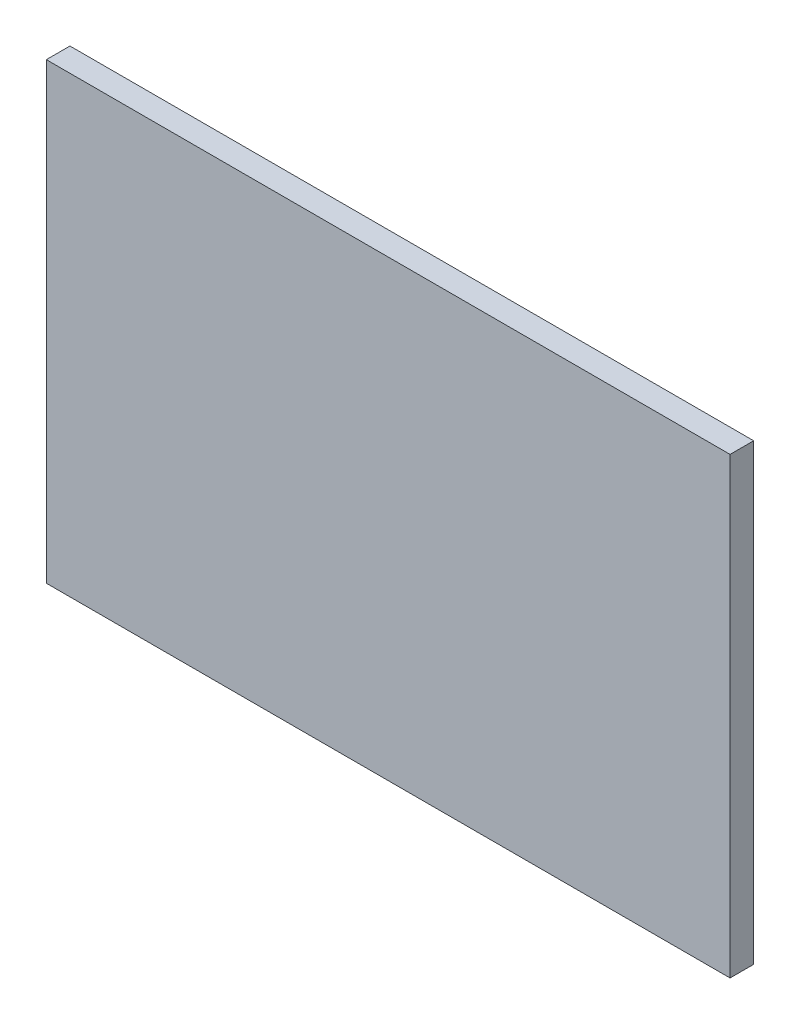
ISO-10303-21;
HEADER;
FILE_DESCRIPTION(('STEP AP214'),'2;1');
FILE_NAME('part.step','',(''),(''),'','','');
FILE_SCHEMA(('AUTOMOTIVE_DESIGN { 1 0 10303 214 1 1 1 1 }'));
ENDSEC;
DATA;
#1=APPLICATION_CONTEXT('core data for automotive mechanical design processes');
#2=APPLICATION_PROTOCOL_DEFINITION('international standard','automotive_design',2000,#1);
#3=PRODUCT_CONTEXT('',#1,'mechanical');
#4=PRODUCT('Part','Part','',(#3));
#5=PRODUCT_RELATED_PRODUCT_CATEGORY('part','',(#4));
#6=PRODUCT_DEFINITION_FORMATION('','',#4);
#7=PRODUCT_DEFINITION_CONTEXT('part definition',#1,'design');
#8=PRODUCT_DEFINITION('design','',#6,#7);
#9=PRODUCT_DEFINITION_SHAPE('','',#8);
#10=(LENGTH_UNIT() NAMED_UNIT(*) SI_UNIT(.MILLI.,.METRE.));
#11=(NAMED_UNIT(*) PLANE_ANGLE_UNIT() SI_UNIT($,.RADIAN.));
#12=(NAMED_UNIT(*) SI_UNIT($,.STERADIAN.) SOLID_ANGLE_UNIT());
#13=UNCERTAINTY_MEASURE_WITH_UNIT(LENGTH_MEASURE(1.E-05),#10,'distance_accuracy_value','');
#14=(GEOMETRIC_REPRESENTATION_CONTEXT(3) GLOBAL_UNCERTAINTY_ASSIGNED_CONTEXT((#13)) GLOBAL_UNIT_ASSIGNED_CONTEXT((#10,
#11,#12)) REPRESENTATION_CONTEXT('',''));
#15=CARTESIAN_POINT('',(0.,0.,0.));
#16=DIRECTION('',(0.,0.,1.));
#17=DIRECTION('',(1.,0.,0.));
#18=AXIS2_PLACEMENT_3D('',#15,#16,#17);
#19=CARTESIAN_POINT('',(-919.1625,1219.2,31.7500000000001));
#20=DIRECTION('',(1.,0.,0.));
#21=DIRECTION('',(0.,0.,-1.));
#22=AXIS2_PLACEMENT_3D('',#19,#20,#21);
#23=PLANE('',#22);
#24=DIRECTION('',(0.,0.,1.));
#25=VECTOR('',#24,1.);
#26=CARTESIAN_POINT('',(-919.1625,0.,31.7500000000001));
#27=LINE('',#26,#25);
#28=CARTESIAN_POINT('',(-919.1625,0.,-31.7499999999999));
#29=VERTEX_POINT('',#28);
#30=CARTESIAN_POINT('',(-919.1625,0.,31.7500000000001));
#31=VERTEX_POINT('',#30);
#32=EDGE_CURVE('E97',#29,#31,#27,.T.);
#33=ORIENTED_EDGE('',*,*,#32,.T.);
#34=DIRECTION('',(0.,-1.,0.));
#35=VECTOR('',#34,1.);
#36=CARTESIAN_POINT('',(-919.1625,1219.2,31.7500000000001));
#37=LINE('',#36,#35);
#38=CARTESIAN_POINT('',(-919.1625,1219.2,31.7500000000001));
#39=VERTEX_POINT('',#38);
#40=EDGE_CURVE('E11',#39,#31,#37,.T.);
#41=ORIENTED_EDGE('',*,*,#40,.F.);
#42=DIRECTION('',(0.,0.,1.));
#43=VECTOR('',#42,1.);
#44=CARTESIAN_POINT('',(-919.1625,1219.2,31.7500000000001));
#45=LINE('',#44,#43);
#46=CARTESIAN_POINT('',(-919.1625,1219.2,-31.7499999999999));
#47=VERTEX_POINT('',#46);
#48=EDGE_CURVE('E85',#47,#39,#45,.T.);
#49=ORIENTED_EDGE('',*,*,#48,.F.);
#50=DIRECTION('',(0.,-1.,0.));
#51=VECTOR('',#50,1.);
#52=CARTESIAN_POINT('',(-919.1625,1219.2,-31.7499999999999));
#53=LINE('',#52,#51);
#54=EDGE_CURVE('E93',#47,#29,#53,.T.);
#55=ORIENTED_EDGE('',*,*,#54,.T.);
#56=EDGE_LOOP('',(#33,#41,#49,#55));
#57=FACE_BOUND('',#56,.T.);
#58=ADVANCED_FACE('F34',(#57),#23,.F.);
#59=CARTESIAN_POINT('',(919.1625,1219.2,31.7499999999999));
#60=DIRECTION('',(0.,0.,-1.));
#61=DIRECTION('',(-1.,0.,0.));
#62=AXIS2_PLACEMENT_3D('',#59,#60,#61);
#63=PLANE('',#62);
#64=DIRECTION('',(1.,0.,0.));
#65=VECTOR('',#64,1.);
#66=CARTESIAN_POINT('',(919.1625,0.,31.7499999999999));
#67=LINE('',#66,#65);
#68=CARTESIAN_POINT('',(919.1625,0.,31.7499999999999));
#69=VERTEX_POINT('',#68);
#70=EDGE_CURVE('E89',#31,#69,#67,.T.);
#71=ORIENTED_EDGE('',*,*,#70,.T.);
#72=DIRECTION('',(0.,-1.,0.));
#73=VECTOR('',#72,1.);
#74=CARTESIAN_POINT('',(919.1625,1219.2,31.7499999999999));
#75=LINE('',#74,#73);
#76=CARTESIAN_POINT('',(919.1625,1219.2,31.7499999999999));
#77=VERTEX_POINT('',#76);
#78=EDGE_CURVE('E42',#77,#69,#75,.T.);
#79=ORIENTED_EDGE('',*,*,#78,.F.);
#80=DIRECTION('',(1.,0.,0.));
#81=VECTOR('',#80,1.);
#82=CARTESIAN_POINT('',(919.1625,1219.2,31.7499999999999));
#83=LINE('',#82,#81);
#84=EDGE_CURVE('E80',#39,#77,#83,.T.);
#85=ORIENTED_EDGE('',*,*,#84,.F.);
#86=ORIENTED_EDGE('',*,*,#40,.T.);
#87=EDGE_LOOP('',(#71,#79,#85,#86));
#88=FACE_BOUND('',#87,.T.);
#89=ADVANCED_FACE('F88',(#88),#63,.F.);
#90=CARTESIAN_POINT('',(919.1625,1219.2,31.7499999999999));
#91=DIRECTION('',(-1.,0.,0.));
#92=DIRECTION('',(0.,0.,1.));
#93=AXIS2_PLACEMENT_3D('',#90,#91,#92);
#94=PLANE('',#93);
#95=DIRECTION('',(0.,0.,-1.));
#96=VECTOR('',#95,1.);
#97=CARTESIAN_POINT('',(919.1625,0.,31.7499999999999));
#98=LINE('',#97,#96);
#99=CARTESIAN_POINT('',(919.1625,0.,-31.7500000000001));
#100=VERTEX_POINT('',#99);
#101=EDGE_CURVE('E67',#69,#100,#98,.T.);
#102=ORIENTED_EDGE('',*,*,#101,.T.);
#103=DIRECTION('',(0.,-1.,0.));
#104=VECTOR('',#103,1.);
#105=CARTESIAN_POINT('',(919.1625,1219.2,-31.7500000000001));
#106=LINE('',#105,#104);
#107=CARTESIAN_POINT('',(919.1625,1219.2,-31.7500000000001));
#108=VERTEX_POINT('',#107);
#109=EDGE_CURVE('E90',#108,#100,#106,.T.);
#110=ORIENTED_EDGE('',*,*,#109,.F.);
#111=DIRECTION('',(0.,0.,-1.));
#112=VECTOR('',#111,1.);
#113=CARTESIAN_POINT('',(919.1625,1219.2,31.7499999999999));
#114=LINE('',#113,#112);
#115=EDGE_CURVE('E83',#77,#108,#114,.T.);
#116=ORIENTED_EDGE('',*,*,#115,.F.);
#117=ORIENTED_EDGE('',*,*,#78,.T.);
#118=EDGE_LOOP('',(#102,#110,#116,#117));
#119=FACE_BOUND('',#118,.T.);
#120=ADVANCED_FACE('F91',(#119),#94,.F.);
#121=CARTESIAN_POINT('',(919.1625,1219.2,-31.7500000000001));
#122=DIRECTION('',(0.,0.,1.));
#123=DIRECTION('',(1.,0.,0.));
#124=AXIS2_PLACEMENT_3D('',#121,#122,#123);
#125=PLANE('',#124);
#126=DIRECTION('',(-1.,0.,0.));
#127=VECTOR('',#126,1.);
#128=CARTESIAN_POINT('',(919.1625,0.,-31.7500000000001));
#129=LINE('',#128,#127);
#130=EDGE_CURVE('E73',#100,#29,#129,.T.);
#131=ORIENTED_EDGE('',*,*,#130,.T.);
#132=ORIENTED_EDGE('',*,*,#54,.F.);
#133=DIRECTION('',(-1.,0.,0.));
#134=VECTOR('',#133,1.);
#135=CARTESIAN_POINT('',(919.1625,1219.2,-31.7500000000001));
#136=LINE('',#135,#134);
#137=EDGE_CURVE('E50',#108,#47,#136,.T.);
#138=ORIENTED_EDGE('',*,*,#137,.F.);
#139=ORIENTED_EDGE('',*,*,#109,.T.);
#140=EDGE_LOOP('',(#131,#132,#138,#139));
#141=FACE_BOUND('',#140,.T.);
#142=ADVANCED_FACE('F104',(#141),#125,.F.);
#143=CARTESIAN_POINT('',(0.,1219.2,0.));
#144=DIRECTION('',(0.,1.,0.));
#145=DIRECTION('',(0.,0.,1.));
#146=AXIS2_PLACEMENT_3D('',#143,#144,#145);
#147=PLANE('',#146);
#148=ORIENTED_EDGE('',*,*,#48,.T.);
#149=ORIENTED_EDGE('',*,*,#84,.T.);
#150=ORIENTED_EDGE('',*,*,#115,.T.);
#151=ORIENTED_EDGE('',*,*,#137,.T.);
#152=EDGE_LOOP('',(#148,#149,#150,#151));
#153=FACE_BOUND('',#152,.T.);
#154=ADVANCED_FACE('F81',(#153),#147,.T.);
#155=CARTESIAN_POINT('',(0.,0.,0.));
#156=DIRECTION('',(0.,1.,0.));
#157=DIRECTION('',(0.,0.,1.));
#158=AXIS2_PLACEMENT_3D('',#155,#156,#157);
#159=PLANE('',#158);
#160=ORIENTED_EDGE('',*,*,#32,.F.);
#161=ORIENTED_EDGE('',*,*,#130,.F.);
#162=ORIENTED_EDGE('',*,*,#101,.F.);
#163=ORIENTED_EDGE('',*,*,#70,.F.);
#164=EDGE_LOOP('',(#160,#161,#162,#163));
#165=FACE_BOUND('',#164,.T.);
#166=ADVANCED_FACE('F107',(#165),#159,.F.);
#167=CLOSED_SHELL('',(#58,#89,#120,#142,#154,#166));
#168=MANIFOLD_SOLID_BREP('B2',#167);
#169=ADVANCED_BREP_SHAPE_REPRESENTATION('',(#18,#168),#14);
#170=SHAPE_DEFINITION_REPRESENTATION(#9,#169);
ENDSEC;
END-ISO-10303-21;
